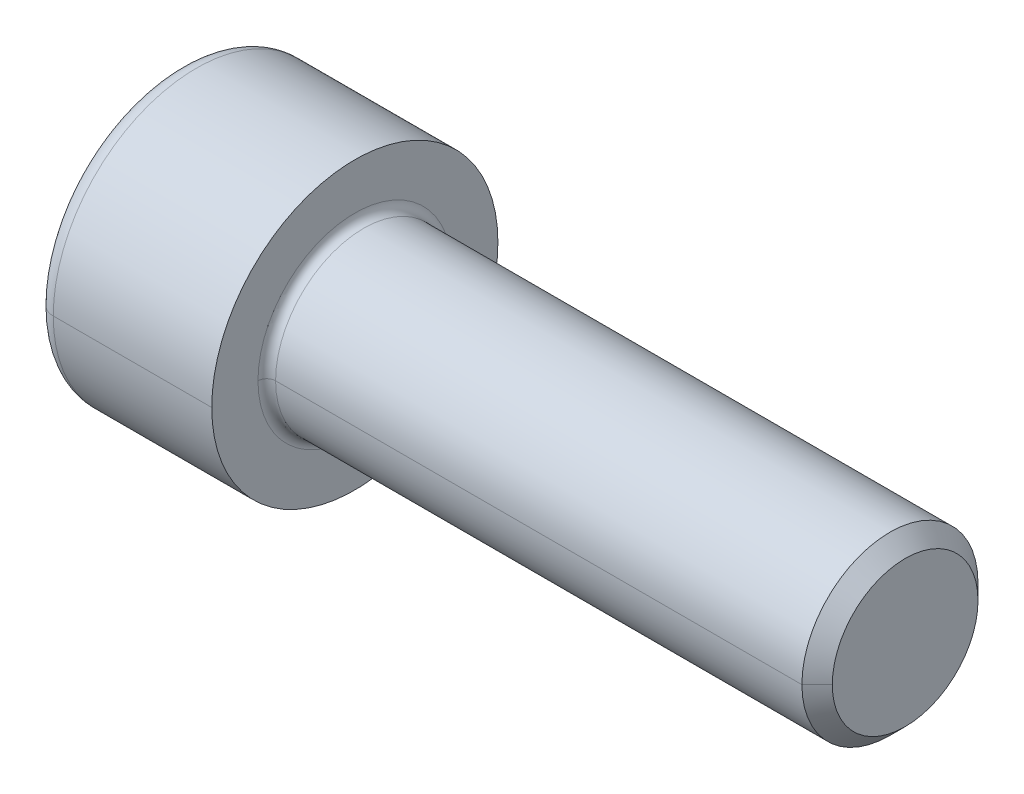
ISO-10303-21;
HEADER;
FILE_DESCRIPTION(('STEP AP214'),'2;1');
FILE_NAME('part.step','',(''),(''),'','','');
FILE_SCHEMA(('AUTOMOTIVE_DESIGN { 1 0 10303 214 1 1 1 1 }'));
ENDSEC;
DATA;
#1=APPLICATION_CONTEXT('core data for automotive mechanical design processes');
#2=APPLICATION_PROTOCOL_DEFINITION('international standard','automotive_design',2000,#1);
#3=PRODUCT_CONTEXT('',#1,'mechanical');
#4=PRODUCT('Part','Part','',(#3));
#5=PRODUCT_RELATED_PRODUCT_CATEGORY('part','',(#4));
#6=PRODUCT_DEFINITION_FORMATION('','',#4);
#7=PRODUCT_DEFINITION_CONTEXT('part definition',#1,'design');
#8=PRODUCT_DEFINITION('design','',#6,#7);
#9=PRODUCT_DEFINITION_SHAPE('','',#8);
#10=(LENGTH_UNIT() NAMED_UNIT(*) SI_UNIT(.MILLI.,.METRE.));
#11=(NAMED_UNIT(*) PLANE_ANGLE_UNIT() SI_UNIT($,.RADIAN.));
#12=(NAMED_UNIT(*) SI_UNIT($,.STERADIAN.) SOLID_ANGLE_UNIT());
#13=UNCERTAINTY_MEASURE_WITH_UNIT(LENGTH_MEASURE(1.E-05),#10,'distance_accuracy_value','');
#14=(GEOMETRIC_REPRESENTATION_CONTEXT(3) GLOBAL_UNCERTAINTY_ASSIGNED_CONTEXT((#13)) GLOBAL_UNIT_ASSIGNED_CONTEXT((#10,
#11,#12)) REPRESENTATION_CONTEXT('',''));
#15=CARTESIAN_POINT('',(0.,0.,0.));
#16=DIRECTION('',(0.,0.,1.));
#17=DIRECTION('',(1.,0.,0.));
#18=AXIS2_PLACEMENT_3D('',#15,#16,#17);
#19=CARTESIAN_POINT('',(4.,0.,0.));
#20=DIRECTION('',(-1.,0.,0.));
#21=DIRECTION('',(0.,0.,1.));
#22=AXIS2_PLACEMENT_3D('',#19,#20,#21);
#23=CONICAL_SURFACE('',#22,3.01,1.0471975511966);
#24=DIRECTION('',(-0.5,0.,0.866025403784436));
#25=VECTOR('',#24,1.);
#26=CARTESIAN_POINT('',(4.,0.,3.01));
#27=LINE('',#26,#25);
#28=CARTESIAN_POINT('',(5.73782431026079,0.,0.));
#29=VERTEX_POINT('',#28);
#30=CARTESIAN_POINT('',(4.,0.,3.01));
#31=VERTEX_POINT('',#30);
#32=EDGE_CURVE('E41',#29,#31,#27,.T.);
#33=ORIENTED_EDGE('',*,*,#32,.F.);
#34=DIRECTION('',(-0.5,0.,-0.866025403784436));
#35=VECTOR('',#34,1.);
#36=CARTESIAN_POINT('',(4.,0.,-3.01));
#37=LINE('',#36,#35);
#38=CARTESIAN_POINT('',(4.,0.,-3.01));
#39=VERTEX_POINT('',#38);
#40=EDGE_CURVE('E11',#29,#39,#37,.T.);
#41=ORIENTED_EDGE('',*,*,#40,.T.);
#42=CARTESIAN_POINT('',(4.,0.,0.));
#43=DIRECTION('',(-1.,0.,0.));
#44=DIRECTION('',(0.,0.,1.));
#45=AXIS2_PLACEMENT_3D('',#42,#43,#44);
#46=CIRCLE('',#45,3.01);
#47=CARTESIAN_POINT('',(4.,-2.60673646539116,-1.505));
#48=VERTEX_POINT('',#47);
#49=EDGE_CURVE('E27',#39,#48,#46,.T.);
#50=ORIENTED_EDGE('',*,*,#49,.T.);
#51=CARTESIAN_POINT('',(4.,0.,0.));
#52=DIRECTION('',(-1.,0.,0.));
#53=DIRECTION('',(0.,0.,1.));
#54=AXIS2_PLACEMENT_3D('',#51,#52,#53);
#55=CIRCLE('',#54,3.01);
#56=CARTESIAN_POINT('',(4.,-2.60673646539116,1.505));
#57=VERTEX_POINT('',#56);
#58=EDGE_CURVE('E294',#48,#57,#55,.T.);
#59=ORIENTED_EDGE('',*,*,#58,.T.);
#60=CARTESIAN_POINT('',(4.,0.,0.));
#61=DIRECTION('',(-1.,0.,0.));
#62=DIRECTION('',(0.,0.,1.));
#63=AXIS2_PLACEMENT_3D('',#60,#61,#62);
#64=CIRCLE('',#63,3.01);
#65=EDGE_CURVE('E245',#57,#31,#64,.T.);
#66=ORIENTED_EDGE('',*,*,#65,.T.);
#67=EDGE_LOOP('',(#33,#41,#50,#59,#66));
#68=FACE_BOUND('',#67,.T.);
#69=ADVANCED_FACE('F16',(#68),#23,.F.);
#70=CARTESIAN_POINT('',(0.8,0.,0.));
#71=DIRECTION('',(-1.,0.,0.));
#72=DIRECTION('',(0.,0.,1.));
#73=AXIS2_PLACEMENT_3D('',#70,#71,#72);
#74=TOROIDAL_SURFACE('',#73,5.7,0.8);
#75=CARTESIAN_POINT('',(0.8,0.,0.));
#76=DIRECTION('',(1.,0.,0.));
#77=DIRECTION('',(0.,0.,1.));
#78=AXIS2_PLACEMENT_3D('',#75,#76,#77);
#79=CIRCLE('',#78,6.5);
#80=CARTESIAN_POINT('',(0.8,0.,-6.5));
#81=VERTEX_POINT('',#80);
#82=CARTESIAN_POINT('',(0.8,0.,6.5));
#83=VERTEX_POINT('',#82);
#84=EDGE_CURVE('E217',#81,#83,#79,.T.);
#85=ORIENTED_EDGE('',*,*,#84,.F.);
#86=CARTESIAN_POINT('',(0.8,0.,-5.7));
#87=DIRECTION('',(0.,1.,0.));
#88=DIRECTION('',(0.,0.,1.));
#89=AXIS2_PLACEMENT_3D('',#86,#87,#88);
#90=CIRCLE('',#89,0.8);
#91=CARTESIAN_POINT('',(0.,0.,-5.7));
#92=VERTEX_POINT('',#91);
#93=EDGE_CURVE('E241',#81,#92,#90,.T.);
#94=ORIENTED_EDGE('',*,*,#93,.T.);
#95=CARTESIAN_POINT('',(0.,0.,0.));
#96=DIRECTION('',(-1.,0.,0.));
#97=DIRECTION('',(0.,0.,1.));
#98=AXIS2_PLACEMENT_3D('',#95,#96,#97);
#99=CIRCLE('',#98,5.7);
#100=CARTESIAN_POINT('',(0.,0.,5.7));
#101=VERTEX_POINT('',#100);
#102=EDGE_CURVE('E257',#101,#92,#99,.T.);
#103=ORIENTED_EDGE('',*,*,#102,.F.);
#104=CARTESIAN_POINT('',(0.8,0.,5.7));
#105=DIRECTION('',(0.,-1.,0.));
#106=DIRECTION('',(0.,0.,-1.));
#107=AXIS2_PLACEMENT_3D('',#104,#105,#106);
#108=CIRCLE('',#107,0.8);
#109=EDGE_CURVE('E148',#83,#101,#108,.T.);
#110=ORIENTED_EDGE('',*,*,#109,.F.);
#111=EDGE_LOOP('',(#85,#94,#103,#110));
#112=FACE_BOUND('',#111,.T.);
#113=ADVANCED_FACE('F458',(#112),#74,.T.);
#114=CARTESIAN_POINT('',(8.4,0.,0.));
#115=DIRECTION('',(1.,0.,0.));
#116=DIRECTION('',(0.,0.,-1.));
#117=AXIS2_PLACEMENT_3D('',#114,#115,#116);
#118=TOROIDAL_SURFACE('',#117,4.4,0.4);
#119=CARTESIAN_POINT('',(8.4,0.,0.));
#120=DIRECTION('',(1.,0.,0.));
#121=DIRECTION('',(0.,0.,-1.));
#122=AXIS2_PLACEMENT_3D('',#119,#120,#121);
#123=CIRCLE('',#122,4.);
#124=CARTESIAN_POINT('',(8.4,0.,4.));
#125=VERTEX_POINT('',#124);
#126=CARTESIAN_POINT('',(8.4,0.,-4.));
#127=VERTEX_POINT('',#126);
#128=EDGE_CURVE('E188',#125,#127,#123,.T.);
#129=ORIENTED_EDGE('',*,*,#128,.F.);
#130=CARTESIAN_POINT('',(8.4,0.,4.4));
#131=DIRECTION('',(0.,1.,0.));
#132=DIRECTION('',(0.,0.,1.));
#133=AXIS2_PLACEMENT_3D('',#130,#131,#132);
#134=CIRCLE('',#133,0.4);
#135=CARTESIAN_POINT('',(8.,0.,4.4));
#136=VERTEX_POINT('',#135);
#137=EDGE_CURVE('E152',#125,#136,#134,.T.);
#138=ORIENTED_EDGE('',*,*,#137,.T.);
#139=CARTESIAN_POINT('',(8.,0.,0.));
#140=DIRECTION('',(-1.,0.,0.));
#141=DIRECTION('',(0.,0.,-1.));
#142=AXIS2_PLACEMENT_3D('',#139,#140,#141);
#143=CIRCLE('',#142,4.4);
#144=CARTESIAN_POINT('',(8.,0.,-4.4));
#145=VERTEX_POINT('',#144);
#146=EDGE_CURVE('E150',#145,#136,#143,.T.);
#147=ORIENTED_EDGE('',*,*,#146,.F.);
#148=CARTESIAN_POINT('',(8.4,0.,-4.4));
#149=DIRECTION('',(0.,-1.,0.));
#150=DIRECTION('',(0.,0.,-1.));
#151=AXIS2_PLACEMENT_3D('',#148,#149,#150);
#152=CIRCLE('',#151,0.4);
#153=EDGE_CURVE('E136',#127,#145,#152,.T.);
#154=ORIENTED_EDGE('',*,*,#153,.F.);
#155=EDGE_LOOP('',(#129,#138,#147,#154));
#156=FACE_BOUND('',#155,.T.);
#157=ADVANCED_FACE('F151',(#156),#118,.F.);
#158=CARTESIAN_POINT('',(33.,0.,0.));
#159=DIRECTION('',(-1.,0.,0.));
#160=DIRECTION('',(0.,0.,1.));
#161=AXIS2_PLACEMENT_3D('',#158,#159,#160);
#162=CONICAL_SURFACE('',#161,3.3095,0.78539816339745);
#163=CARTESIAN_POINT('',(33.,0.,0.));
#164=DIRECTION('',(-1.,0.,0.));
#165=DIRECTION('',(0.,0.,1.));
#166=AXIS2_PLACEMENT_3D('',#163,#164,#165);
#167=CIRCLE('',#166,3.3095);
#168=CARTESIAN_POINT('',(33.,0.,3.3095));
#169=VERTEX_POINT('',#168);
#170=CARTESIAN_POINT('',(33.,0.,-3.3095));
#171=VERTEX_POINT('',#170);
#172=EDGE_CURVE('E273',#169,#171,#167,.T.);
#173=ORIENTED_EDGE('',*,*,#172,.T.);
#174=DIRECTION('',(-0.707106781186546,0.,-0.707106781186549));
#175=VECTOR('',#174,1.);
#176=CARTESIAN_POINT('',(33.,0.,-3.3095));
#177=LINE('',#176,#175);
#178=CARTESIAN_POINT('',(32.3095,0.,-4.));
#179=VERTEX_POINT('',#178);
#180=EDGE_CURVE('E403',#171,#179,#177,.T.);
#181=ORIENTED_EDGE('',*,*,#180,.T.);
#182=CARTESIAN_POINT('',(32.3095,0.,0.));
#183=DIRECTION('',(-1.,0.,0.));
#184=DIRECTION('',(0.,0.,1.));
#185=AXIS2_PLACEMENT_3D('',#182,#183,#184);
#186=CIRCLE('',#185,4.);
#187=CARTESIAN_POINT('',(32.3095,0.,4.));
#188=VERTEX_POINT('',#187);
#189=EDGE_CURVE('E222',#188,#179,#186,.T.);
#190=ORIENTED_EDGE('',*,*,#189,.F.);
#191=DIRECTION('',(-0.707106781186546,0.,0.707106781186549));
#192=VECTOR('',#191,1.);
#193=CARTESIAN_POINT('',(33.,0.,3.3095));
#194=LINE('',#193,#192);
#195=EDGE_CURVE('E147',#169,#188,#194,.T.);
#196=ORIENTED_EDGE('',*,*,#195,.F.);
#197=EDGE_LOOP('',(#173,#181,#190,#196));
#198=FACE_BOUND('',#197,.T.);
#199=ADVANCED_FACE('F417',(#198),#162,.T.);
#200=CARTESIAN_POINT('',(-31.75,0.,0.));
#201=DIRECTION('',(-1.,0.,0.));
#202=DIRECTION('',(0.,0.,1.));
#203=AXIS2_PLACEMENT_3D('',#200,#201,#202);
#204=CYLINDRICAL_SURFACE('',#203,4.);
#205=ORIENTED_EDGE('',*,*,#189,.T.);
#206=DIRECTION('',(-1.,0.,0.));
#207=VECTOR('',#206,1.);
#208=CARTESIAN_POINT('',(-31.75,0.,-4.));
#209=LINE('',#208,#207);
#210=EDGE_CURVE('E218',#179,#127,#209,.T.);
#211=ORIENTED_EDGE('',*,*,#210,.T.);
#212=CARTESIAN_POINT('',(8.4,0.,0.));
#213=DIRECTION('',(1.,0.,0.));
#214=DIRECTION('',(0.,0.,-1.));
#215=AXIS2_PLACEMENT_3D('',#212,#213,#214);
#216=CIRCLE('',#215,4.);
#217=EDGE_CURVE('E143',#127,#125,#216,.T.);
#218=ORIENTED_EDGE('',*,*,#217,.T.);
#219=DIRECTION('',(-1.,0.,0.));
#220=VECTOR('',#219,1.);
#221=CARTESIAN_POINT('',(-31.75,0.,4.));
#222=LINE('',#221,#220);
#223=EDGE_CURVE('E166',#188,#125,#222,.T.);
#224=ORIENTED_EDGE('',*,*,#223,.F.);
#225=EDGE_LOOP('',(#205,#211,#218,#224));
#226=FACE_BOUND('',#225,.T.);
#227=ADVANCED_FACE('F481',(#226),#204,.T.);
#228=CARTESIAN_POINT('',(-31.75,0.,0.));
#229=DIRECTION('',(-1.,0.,0.));
#230=DIRECTION('',(0.,0.,1.));
#231=AXIS2_PLACEMENT_3D('',#228,#229,#230);
#232=CYLINDRICAL_SURFACE('',#231,6.5);
#233=CARTESIAN_POINT('',(8.,0.,0.));
#234=DIRECTION('',(-1.,0.,0.));
#235=DIRECTION('',(0.,0.,1.));
#236=AXIS2_PLACEMENT_3D('',#233,#234,#235);
#237=CIRCLE('',#236,6.5);
#238=CARTESIAN_POINT('',(8.,0.,6.5));
#239=VERTEX_POINT('',#238);
#240=CARTESIAN_POINT('',(8.,0.,-6.5));
#241=VERTEX_POINT('',#240);
#242=EDGE_CURVE('E216',#239,#241,#237,.T.);
#243=ORIENTED_EDGE('',*,*,#242,.T.);
#244=DIRECTION('',(-1.,0.,0.));
#245=VECTOR('',#244,1.);
#246=CARTESIAN_POINT('',(-31.75,0.,-6.5));
#247=LINE('',#246,#245);
#248=EDGE_CURVE('E212',#241,#81,#247,.T.);
#249=ORIENTED_EDGE('',*,*,#248,.T.);
#250=ORIENTED_EDGE('',*,*,#84,.T.);
#251=DIRECTION('',(-1.,0.,0.));
#252=VECTOR('',#251,1.);
#253=CARTESIAN_POINT('',(-31.75,0.,6.5));
#254=LINE('',#253,#252);
#255=EDGE_CURVE('E249',#239,#83,#254,.T.);
#256=ORIENTED_EDGE('',*,*,#255,.F.);
#257=EDGE_LOOP('',(#243,#249,#250,#256));
#258=FACE_BOUND('',#257,.T.);
#259=ADVANCED_FACE('F18',(#258),#232,.T.);
#260=CARTESIAN_POINT('',(0.,0.,0.));
#261=DIRECTION('',(-1.,0.,0.));
#262=DIRECTION('',(0.,0.,1.));
#263=AXIS2_PLACEMENT_3D('',#260,#261,#262);
#264=PLANE('',#263);
#265=ORIENTED_EDGE('',*,*,#102,.T.);
#266=CARTESIAN_POINT('',(0.,0.,0.));
#267=DIRECTION('',(-1.,0.,0.));
#268=DIRECTION('',(0.,0.,1.));
#269=AXIS2_PLACEMENT_3D('',#266,#267,#268);
#270=CIRCLE('',#269,5.7);
#271=EDGE_CURVE('E253',#92,#101,#270,.T.);
#272=ORIENTED_EDGE('',*,*,#271,.T.);
#273=EDGE_LOOP('',(#265,#272));
#274=FACE_BOUND('',#273,.T.);
#275=DIRECTION('',(0.,-0.5,0.866025403784439));
#276=VECTOR('',#275,1.);
#277=CARTESIAN_POINT('',(0.,3.47564862052154,0.));
#278=LINE('',#277,#276);
#279=CARTESIAN_POINT('',(0.,3.47564862052154,0.));
#280=VERTEX_POINT('',#279);
#281=CARTESIAN_POINT('',(0.,1.73782431026077,3.01));
#282=VERTEX_POINT('',#281);
#283=EDGE_CURVE('E179',#280,#282,#278,.T.);
#284=ORIENTED_EDGE('',*,*,#283,.T.);
#285=DIRECTION('',(0.,1.,0.));
#286=VECTOR('',#285,1.);
#287=CARTESIAN_POINT('',(0.,-1.73782431026077,3.01));
#288=LINE('',#287,#286);
#289=CARTESIAN_POINT('',(0.,-1.73782431026077,3.01));
#290=VERTEX_POINT('',#289);
#291=EDGE_CURVE('E187',#290,#282,#288,.T.);
#292=ORIENTED_EDGE('',*,*,#291,.F.);
#293=DIRECTION('',(0.,-0.5,-0.866025403784438));
#294=VECTOR('',#293,1.);
#295=CARTESIAN_POINT('',(0.,-1.73782431026077,3.01));
#296=LINE('',#295,#294);
#297=CARTESIAN_POINT('',(0.,-3.47564862052155,0.));
#298=VERTEX_POINT('',#297);
#299=EDGE_CURVE('E176',#290,#298,#296,.T.);
#300=ORIENTED_EDGE('',*,*,#299,.T.);
#301=DIRECTION('',(0.,0.5,-0.866025403784439));
#302=VECTOR('',#301,1.);
#303=CARTESIAN_POINT('',(0.,-3.47564862052155,0.));
#304=LINE('',#303,#302);
#305=CARTESIAN_POINT('',(0.,-1.73782431026078,-3.01));
#306=VERTEX_POINT('',#305);
#307=EDGE_CURVE('E180',#298,#306,#304,.T.);
#308=ORIENTED_EDGE('',*,*,#307,.T.);
#309=DIRECTION('',(0.,-1.,0.));
#310=VECTOR('',#309,1.);
#311=CARTESIAN_POINT('',(0.,1.73782431026077,-3.01));
#312=LINE('',#311,#310);
#313=CARTESIAN_POINT('',(0.,1.73782431026077,-3.01));
#314=VERTEX_POINT('',#313);
#315=EDGE_CURVE('E202',#314,#306,#312,.T.);
#316=ORIENTED_EDGE('',*,*,#315,.F.);
#317=DIRECTION('',(0.,-0.5,-0.866025403784438));
#318=VECTOR('',#317,1.);
#319=CARTESIAN_POINT('',(0.,3.47564862052154,0.));
#320=LINE('',#319,#318);
#321=EDGE_CURVE('E203',#280,#314,#320,.T.);
#322=ORIENTED_EDGE('',*,*,#321,.F.);
#323=EDGE_LOOP('',(#284,#292,#300,#308,#316,#322));
#324=FACE_BOUND('',#323,.T.);
#325=ADVANCED_FACE('F378',(#274,#324),#264,.T.);
#326=CARTESIAN_POINT('',(-31.75,0.,0.));
#327=DIRECTION('',(-1.,0.,0.));
#328=DIRECTION('',(0.,0.,1.));
#329=AXIS2_PLACEMENT_3D('',#326,#327,#328);
#330=CYLINDRICAL_SURFACE('',#329,6.5);
#331=ORIENTED_EDGE('',*,*,#248,.F.);
#332=CARTESIAN_POINT('',(8.,0.,0.));
#333=DIRECTION('',(-1.,0.,0.));
#334=DIRECTION('',(0.,0.,1.));
#335=AXIS2_PLACEMENT_3D('',#332,#333,#334);
#336=CIRCLE('',#335,6.5);
#337=EDGE_CURVE('E226',#241,#239,#336,.T.);
#338=ORIENTED_EDGE('',*,*,#337,.T.);
#339=ORIENTED_EDGE('',*,*,#255,.T.);
#340=CARTESIAN_POINT('',(0.8,0.,0.));
#341=DIRECTION('',(1.,0.,0.));
#342=DIRECTION('',(0.,0.,1.));
#343=AXIS2_PLACEMENT_3D('',#340,#341,#342);
#344=CIRCLE('',#343,6.5);
#345=EDGE_CURVE('E155',#83,#81,#344,.T.);
#346=ORIENTED_EDGE('',*,*,#345,.T.);
#347=EDGE_LOOP('',(#331,#338,#339,#346));
#348=FACE_BOUND('',#347,.T.);
#349=ADVANCED_FACE('F472',(#348),#330,.T.);
#350=CARTESIAN_POINT('',(8.,6.5,0.));
#351=DIRECTION('',(1.,0.,0.));
#352=DIRECTION('',(0.,1.,0.));
#353=AXIS2_PLACEMENT_3D('',#350,#351,#352);
#354=PLANE('',#353);
#355=ORIENTED_EDGE('',*,*,#242,.F.);
#356=ORIENTED_EDGE('',*,*,#337,.F.);
#357=EDGE_LOOP('',(#355,#356));
#358=FACE_BOUND('',#357,.T.);
#359=ORIENTED_EDGE('',*,*,#146,.T.);
#360=CARTESIAN_POINT('',(8.,0.,0.));
#361=DIRECTION('',(-1.,0.,0.));
#362=DIRECTION('',(0.,0.,-1.));
#363=AXIS2_PLACEMENT_3D('',#360,#361,#362);
#364=CIRCLE('',#363,4.4);
#365=EDGE_CURVE('E141',#136,#145,#364,.T.);
#366=ORIENTED_EDGE('',*,*,#365,.T.);
#367=EDGE_LOOP('',(#359,#366));
#368=FACE_BOUND('',#367,.T.);
#369=ADVANCED_FACE('F157',(#358,#368),#354,.T.);
#370=CARTESIAN_POINT('',(-31.75,0.,0.));
#371=DIRECTION('',(-1.,0.,0.));
#372=DIRECTION('',(0.,0.,1.));
#373=AXIS2_PLACEMENT_3D('',#370,#371,#372);
#374=CYLINDRICAL_SURFACE('',#373,4.);
#375=ORIENTED_EDGE('',*,*,#210,.F.);
#376=CARTESIAN_POINT('',(32.3095,0.,0.));
#377=DIRECTION('',(-1.,0.,0.));
#378=DIRECTION('',(0.,0.,1.));
#379=AXIS2_PLACEMENT_3D('',#376,#377,#378);
#380=CIRCLE('',#379,4.);
#381=EDGE_CURVE('E159',#179,#188,#380,.T.);
#382=ORIENTED_EDGE('',*,*,#381,.T.);
#383=ORIENTED_EDGE('',*,*,#223,.T.);
#384=ORIENTED_EDGE('',*,*,#128,.T.);
#385=EDGE_LOOP('',(#375,#382,#383,#384));
#386=FACE_BOUND('',#385,.T.);
#387=ADVANCED_FACE('F471',(#386),#374,.T.);
#388=CARTESIAN_POINT('',(33.,0.,0.));
#389=DIRECTION('',(-1.,0.,0.));
#390=DIRECTION('',(0.,0.,1.));
#391=AXIS2_PLACEMENT_3D('',#388,#389,#390);
#392=CONICAL_SURFACE('',#391,3.3095,0.78539816339745);
#393=ORIENTED_EDGE('',*,*,#180,.F.);
#394=CARTESIAN_POINT('',(33.,0.,0.));
#395=DIRECTION('',(-1.,0.,0.));
#396=DIRECTION('',(0.,0.,1.));
#397=AXIS2_PLACEMENT_3D('',#394,#395,#396);
#398=CIRCLE('',#397,3.3095);
#399=EDGE_CURVE('E191',#171,#169,#398,.T.);
#400=ORIENTED_EDGE('',*,*,#399,.T.);
#401=ORIENTED_EDGE('',*,*,#195,.T.);
#402=ORIENTED_EDGE('',*,*,#381,.F.);
#403=EDGE_LOOP('',(#393,#400,#401,#402));
#404=FACE_BOUND('',#403,.T.);
#405=ADVANCED_FACE('F424',(#404),#392,.T.);
#406=CARTESIAN_POINT('',(33.,3.3095,0.));
#407=DIRECTION('',(1.,0.,0.));
#408=DIRECTION('',(0.,1.,0.));
#409=AXIS2_PLACEMENT_3D('',#406,#407,#408);
#410=PLANE('',#409);
#411=ORIENTED_EDGE('',*,*,#172,.F.);
#412=ORIENTED_EDGE('',*,*,#399,.F.);
#413=EDGE_LOOP('',(#411,#412));
#414=FACE_BOUND('',#413,.T.);
#415=ADVANCED_FACE('F422',(#414),#410,.T.);
#416=CARTESIAN_POINT('',(8.4,0.,0.));
#417=DIRECTION('',(1.,0.,0.));
#418=DIRECTION('',(0.,0.,-1.));
#419=AXIS2_PLACEMENT_3D('',#416,#417,#418);
#420=TOROIDAL_SURFACE('',#419,4.4,0.4);
#421=ORIENTED_EDGE('',*,*,#137,.F.);
#422=ORIENTED_EDGE('',*,*,#217,.F.);
#423=ORIENTED_EDGE('',*,*,#153,.T.);
#424=ORIENTED_EDGE('',*,*,#365,.F.);
#425=EDGE_LOOP('',(#421,#422,#423,#424));
#426=FACE_BOUND('',#425,.T.);
#427=ADVANCED_FACE('F139',(#426),#420,.F.);
#428=CARTESIAN_POINT('',(0.8,0.,0.));
#429=DIRECTION('',(-1.,0.,0.));
#430=DIRECTION('',(0.,0.,1.));
#431=AXIS2_PLACEMENT_3D('',#428,#429,#430);
#432=TOROIDAL_SURFACE('',#431,5.7,0.8);
#433=ORIENTED_EDGE('',*,*,#93,.F.);
#434=ORIENTED_EDGE('',*,*,#345,.F.);
#435=ORIENTED_EDGE('',*,*,#109,.T.);
#436=ORIENTED_EDGE('',*,*,#271,.F.);
#437=EDGE_LOOP('',(#433,#434,#435,#436));
#438=FACE_BOUND('',#437,.T.);
#439=ADVANCED_FACE('F478',(#438),#432,.T.);
#440=CARTESIAN_POINT('',(4.,3.47564862052154,0.));
#441=DIRECTION('',(0.,-0.866025403784439,-0.5));
#442=DIRECTION('',(0.,0.5,-0.866025403784439));
#443=AXIS2_PLACEMENT_3D('',#440,#441,#442);
#444=PLANE('',#443);
#445=ORIENTED_EDGE('',*,*,#283,.F.);
#446=DIRECTION('',(-1.,0.,0.));
#447=VECTOR('',#446,1.);
#448=CARTESIAN_POINT('',(4.,3.47564862052154,0.));
#449=LINE('',#448,#447);
#450=CARTESIAN_POINT('',(4.,3.47564862052154,0.));
#451=VERTEX_POINT('',#450);
#452=EDGE_CURVE('E196',#451,#280,#449,.T.);
#453=ORIENTED_EDGE('',*,*,#452,.F.);
#454=DIRECTION('',(0.,-0.5,0.866025403784439));
#455=VECTOR('',#454,1.);
#456=CARTESIAN_POINT('',(4.,3.47564862052154,0.));
#457=LINE('',#456,#455);
#458=CARTESIAN_POINT('',(4.,2.60673646539116,1.505));
#459=VERTEX_POINT('',#458);
#460=EDGE_CURVE('E230',#451,#459,#457,.T.);
#461=ORIENTED_EDGE('',*,*,#460,.T.);
#462=DIRECTION('',(0.,-0.5,0.866025403784439));
#463=VECTOR('',#462,1.);
#464=CARTESIAN_POINT('',(4.,3.47564862052154,0.));
#465=LINE('',#464,#463);
#466=CARTESIAN_POINT('',(4.,1.73782431026077,3.01));
#467=VERTEX_POINT('',#466);
#468=EDGE_CURVE('E186',#459,#467,#465,.T.);
#469=ORIENTED_EDGE('',*,*,#468,.T.);
#470=DIRECTION('',(-1.,0.,0.));
#471=VECTOR('',#470,1.);
#472=CARTESIAN_POINT('',(4.,1.73782431026077,3.01));
#473=LINE('',#472,#471);
#474=EDGE_CURVE('E182',#467,#282,#473,.T.);
#475=ORIENTED_EDGE('',*,*,#474,.T.);
#476=EDGE_LOOP('',(#445,#453,#461,#469,#475));
#477=FACE_BOUND('',#476,.T.);
#478=ADVANCED_FACE('F392',(#477),#444,.T.);
#479=CARTESIAN_POINT('',(4.,-1.73782431026077,3.01));
#480=DIRECTION('',(0.,0.,1.));
#481=DIRECTION('',(0.,-1.,0.));
#482=AXIS2_PLACEMENT_3D('',#479,#480,#481);
#483=PLANE('',#482);
#484=ORIENTED_EDGE('',*,*,#291,.T.);
#485=ORIENTED_EDGE('',*,*,#474,.F.);
#486=DIRECTION('',(0.,1.,0.));
#487=VECTOR('',#486,1.);
#488=CARTESIAN_POINT('',(4.,-1.73782431026077,3.01));
#489=LINE('',#488,#487);
#490=EDGE_CURVE('E231',#31,#467,#489,.T.);
#491=ORIENTED_EDGE('',*,*,#490,.F.);
#492=DIRECTION('',(0.,1.,0.));
#493=VECTOR('',#492,1.);
#494=CARTESIAN_POINT('',(4.,-1.73782431026077,3.01));
#495=LINE('',#494,#493);
#496=CARTESIAN_POINT('',(4.,-1.73782431026077,3.01));
#497=VERTEX_POINT('',#496);
#498=EDGE_CURVE('E197',#497,#31,#495,.T.);
#499=ORIENTED_EDGE('',*,*,#498,.F.);
#500=DIRECTION('',(-1.,0.,0.));
#501=VECTOR('',#500,1.);
#502=CARTESIAN_POINT('',(4.,-1.73782431026077,3.01));
#503=LINE('',#502,#501);
#504=EDGE_CURVE('E204',#497,#290,#503,.T.);
#505=ORIENTED_EDGE('',*,*,#504,.T.);
#506=EDGE_LOOP('',(#484,#485,#491,#499,#505));
#507=FACE_BOUND('',#506,.T.);
#508=ADVANCED_FACE('F439',(#507),#483,.F.);
#509=CARTESIAN_POINT('',(4.,-1.73782431026077,3.01));
#510=DIRECTION('',(0.,0.866025403784438,-0.5));
#511=DIRECTION('',(-1.,0.,0.));
#512=AXIS2_PLACEMENT_3D('',#509,#510,#511);
#513=PLANE('',#512);
#514=ORIENTED_EDGE('',*,*,#299,.F.);
#515=ORIENTED_EDGE('',*,*,#504,.F.);
#516=DIRECTION('',(0.,-0.5,-0.866025403784438));
#517=VECTOR('',#516,1.);
#518=CARTESIAN_POINT('',(4.,-1.73782431026077,3.01));
#519=LINE('',#518,#517);
#520=EDGE_CURVE('E208',#497,#57,#519,.T.);
#521=ORIENTED_EDGE('',*,*,#520,.T.);
#522=DIRECTION('',(0.,-0.5,-0.866025403784438));
#523=VECTOR('',#522,1.);
#524=CARTESIAN_POINT('',(4.,-1.73782431026077,3.01));
#525=LINE('',#524,#523);
#526=CARTESIAN_POINT('',(4.,-3.47564862052155,0.));
#527=VERTEX_POINT('',#526);
#528=EDGE_CURVE('E274',#57,#527,#525,.T.);
#529=ORIENTED_EDGE('',*,*,#528,.T.);
#530=DIRECTION('',(-1.,0.,0.));
#531=VECTOR('',#530,1.);
#532=CARTESIAN_POINT('',(4.,-3.47564862052155,0.));
#533=LINE('',#532,#531);
#534=EDGE_CURVE('E20',#527,#298,#533,.T.);
#535=ORIENTED_EDGE('',*,*,#534,.T.);
#536=EDGE_LOOP('',(#514,#515,#521,#529,#535));
#537=FACE_BOUND('',#536,.T.);
#538=ADVANCED_FACE('F338',(#537),#513,.T.);
#539=CARTESIAN_POINT('',(4.,-3.47564862052155,0.));
#540=DIRECTION('',(0.,0.866025403784439,0.5));
#541=DIRECTION('',(1.,0.,0.));
#542=AXIS2_PLACEMENT_3D('',#539,#540,#541);
#543=PLANE('',#542);
#544=ORIENTED_EDGE('',*,*,#307,.F.);
#545=ORIENTED_EDGE('',*,*,#534,.F.);
#546=DIRECTION('',(0.,0.5,-0.866025403784439));
#547=VECTOR('',#546,1.);
#548=CARTESIAN_POINT('',(4.,-3.47564862052155,0.));
#549=LINE('',#548,#547);
#550=EDGE_CURVE('E309',#527,#48,#549,.T.);
#551=ORIENTED_EDGE('',*,*,#550,.T.);
#552=DIRECTION('',(0.,0.5,-0.866025403784439));
#553=VECTOR('',#552,1.);
#554=CARTESIAN_POINT('',(4.,-3.47564862052155,0.));
#555=LINE('',#554,#553);
#556=CARTESIAN_POINT('',(4.,-1.73782431026078,-3.01));
#557=VERTEX_POINT('',#556);
#558=EDGE_CURVE('E311',#48,#557,#555,.T.);
#559=ORIENTED_EDGE('',*,*,#558,.T.);
#560=DIRECTION('',(-1.,0.,0.));
#561=VECTOR('',#560,1.);
#562=CARTESIAN_POINT('',(4.,-1.73782431026078,-3.01));
#563=LINE('',#562,#561);
#564=EDGE_CURVE('E319',#557,#306,#563,.T.);
#565=ORIENTED_EDGE('',*,*,#564,.T.);
#566=EDGE_LOOP('',(#544,#545,#551,#559,#565));
#567=FACE_BOUND('',#566,.T.);
#568=ADVANCED_FACE('F437',(#567),#543,.T.);
#569=CARTESIAN_POINT('',(4.,1.73782431026077,-3.01));
#570=DIRECTION('',(0.,0.,-1.));
#571=DIRECTION('',(0.,-1.,0.));
#572=AXIS2_PLACEMENT_3D('',#569,#570,#571);
#573=PLANE('',#572);
#574=ORIENTED_EDGE('',*,*,#315,.T.);
#575=ORIENTED_EDGE('',*,*,#564,.F.);
#576=DIRECTION('',(0.,-1.,0.));
#577=VECTOR('',#576,1.);
#578=CARTESIAN_POINT('',(4.,1.73782431026077,-3.01));
#579=LINE('',#578,#577);
#580=EDGE_CURVE('E192',#39,#557,#579,.T.);
#581=ORIENTED_EDGE('',*,*,#580,.F.);
#582=DIRECTION('',(0.,-1.,0.));
#583=VECTOR('',#582,1.);
#584=CARTESIAN_POINT('',(4.,1.73782431026077,-3.01));
#585=LINE('',#584,#583);
#586=CARTESIAN_POINT('',(4.,1.73782431026077,-3.01));
#587=VERTEX_POINT('',#586);
#588=EDGE_CURVE('E174',#587,#39,#585,.T.);
#589=ORIENTED_EDGE('',*,*,#588,.F.);
#590=DIRECTION('',(-1.,0.,0.));
#591=VECTOR('',#590,1.);
#592=CARTESIAN_POINT('',(4.,1.73782431026077,-3.01));
#593=LINE('',#592,#591);
#594=EDGE_CURVE('E198',#587,#314,#593,.T.);
#595=ORIENTED_EDGE('',*,*,#594,.T.);
#596=EDGE_LOOP('',(#574,#575,#581,#589,#595));
#597=FACE_BOUND('',#596,.T.);
#598=ADVANCED_FACE('F381',(#597),#573,.F.);
#599=CARTESIAN_POINT('',(4.,3.47564862052154,0.));
#600=DIRECTION('',(0.,0.866025403784438,-0.5));
#601=DIRECTION('',(-1.,0.,0.));
#602=AXIS2_PLACEMENT_3D('',#599,#600,#601);
#603=PLANE('',#602);
#604=ORIENTED_EDGE('',*,*,#321,.T.);
#605=ORIENTED_EDGE('',*,*,#594,.F.);
#606=DIRECTION('',(0.,-0.5,-0.866025403784438));
#607=VECTOR('',#606,1.);
#608=CARTESIAN_POINT('',(4.,3.47564862052154,0.));
#609=LINE('',#608,#607);
#610=CARTESIAN_POINT('',(4.,2.60673646539116,-1.505));
#611=VERTEX_POINT('',#610);
#612=EDGE_CURVE('E264',#611,#587,#609,.T.);
#613=ORIENTED_EDGE('',*,*,#612,.F.);
#614=DIRECTION('',(0.,-0.5,-0.866025403784438));
#615=VECTOR('',#614,1.);
#616=CARTESIAN_POINT('',(4.,3.47564862052154,0.));
#617=LINE('',#616,#615);
#618=EDGE_CURVE('E235',#451,#611,#617,.T.);
#619=ORIENTED_EDGE('',*,*,#618,.F.);
#620=ORIENTED_EDGE('',*,*,#452,.T.);
#621=EDGE_LOOP('',(#604,#605,#613,#619,#620));
#622=FACE_BOUND('',#621,.T.);
#623=ADVANCED_FACE('F371',(#622),#603,.F.);
#624=CARTESIAN_POINT('',(4.,0.,6.02));
#625=DIRECTION('',(1.,0.,0.));
#626=DIRECTION('',(0.,1.,0.));
#627=AXIS2_PLACEMENT_3D('',#624,#625,#626);
#628=PLANE('',#627);
#629=ORIENTED_EDGE('',*,*,#580,.T.);
#630=ORIENTED_EDGE('',*,*,#558,.F.);
#631=ORIENTED_EDGE('',*,*,#49,.F.);
#632=EDGE_LOOP('',(#629,#630,#631));
#633=FACE_BOUND('',#632,.T.);
#634=ADVANCED_FACE('F453',(#633),#628,.F.);
#635=CARTESIAN_POINT('',(4.,0.,6.02));
#636=DIRECTION('',(1.,0.,0.));
#637=DIRECTION('',(0.,1.,0.));
#638=AXIS2_PLACEMENT_3D('',#635,#636,#637);
#639=PLANE('',#638);
#640=ORIENTED_EDGE('',*,*,#550,.F.);
#641=ORIENTED_EDGE('',*,*,#528,.F.);
#642=ORIENTED_EDGE('',*,*,#58,.F.);
#643=EDGE_LOOP('',(#640,#641,#642));
#644=FACE_BOUND('',#643,.T.);
#645=ADVANCED_FACE('F334',(#644),#639,.F.);
#646=CARTESIAN_POINT('',(4.,0.,6.02));
#647=DIRECTION('',(1.,0.,0.));
#648=DIRECTION('',(0.,1.,0.));
#649=AXIS2_PLACEMENT_3D('',#646,#647,#648);
#650=PLANE('',#649);
#651=ORIENTED_EDGE('',*,*,#520,.F.);
#652=ORIENTED_EDGE('',*,*,#498,.T.);
#653=ORIENTED_EDGE('',*,*,#65,.F.);
#654=EDGE_LOOP('',(#651,#652,#653));
#655=FACE_BOUND('',#654,.T.);
#656=ADVANCED_FACE('F442',(#655),#650,.F.);
#657=CARTESIAN_POINT('',(4.,0.,6.02));
#658=DIRECTION('',(1.,0.,0.));
#659=DIRECTION('',(0.,1.,0.));
#660=AXIS2_PLACEMENT_3D('',#657,#658,#659);
#661=PLANE('',#660);
#662=ORIENTED_EDGE('',*,*,#490,.T.);
#663=ORIENTED_EDGE('',*,*,#468,.F.);
#664=CARTESIAN_POINT('',(4.,0.,0.));
#665=DIRECTION('',(-1.,0.,0.));
#666=DIRECTION('',(0.,0.,1.));
#667=AXIS2_PLACEMENT_3D('',#664,#665,#666);
#668=CIRCLE('',#667,3.01);
#669=EDGE_CURVE('E175',#31,#459,#668,.T.);
#670=ORIENTED_EDGE('',*,*,#669,.F.);
#671=EDGE_LOOP('',(#662,#663,#670));
#672=FACE_BOUND('',#671,.T.);
#673=ADVANCED_FACE('F444',(#672),#661,.F.);
#674=CARTESIAN_POINT('',(4.,0.,6.02));
#675=DIRECTION('',(1.,0.,0.));
#676=DIRECTION('',(0.,1.,0.));
#677=AXIS2_PLACEMENT_3D('',#674,#675,#676);
#678=PLANE('',#677);
#679=ORIENTED_EDGE('',*,*,#460,.F.);
#680=ORIENTED_EDGE('',*,*,#618,.T.);
#681=CARTESIAN_POINT('',(4.,0.,0.));
#682=DIRECTION('',(-1.,0.,0.));
#683=DIRECTION('',(0.,0.,1.));
#684=AXIS2_PLACEMENT_3D('',#681,#682,#683);
#685=CIRCLE('',#684,3.01);
#686=EDGE_CURVE('E211',#459,#611,#685,.T.);
#687=ORIENTED_EDGE('',*,*,#686,.F.);
#688=EDGE_LOOP('',(#679,#680,#687));
#689=FACE_BOUND('',#688,.T.);
#690=ADVANCED_FACE('F389',(#689),#678,.F.);
#691=CARTESIAN_POINT('',(4.,0.,6.02));
#692=DIRECTION('',(1.,0.,0.));
#693=DIRECTION('',(0.,1.,0.));
#694=AXIS2_PLACEMENT_3D('',#691,#692,#693);
#695=PLANE('',#694);
#696=ORIENTED_EDGE('',*,*,#612,.T.);
#697=ORIENTED_EDGE('',*,*,#588,.T.);
#698=CARTESIAN_POINT('',(4.,0.,0.));
#699=DIRECTION('',(-1.,0.,0.));
#700=DIRECTION('',(0.,0.,1.));
#701=AXIS2_PLACEMENT_3D('',#698,#699,#700);
#702=CIRCLE('',#701,3.01);
#703=EDGE_CURVE('E170',#611,#39,#702,.T.);
#704=ORIENTED_EDGE('',*,*,#703,.F.);
#705=EDGE_LOOP('',(#696,#697,#704));
#706=FACE_BOUND('',#705,.T.);
#707=ADVANCED_FACE('F384',(#706),#695,.F.);
#708=CARTESIAN_POINT('',(4.,0.,0.));
#709=DIRECTION('',(-1.,0.,0.));
#710=DIRECTION('',(0.,0.,1.));
#711=AXIS2_PLACEMENT_3D('',#708,#709,#710);
#712=CONICAL_SURFACE('',#711,3.01,1.0471975511966);
#713=ORIENTED_EDGE('',*,*,#40,.F.);
#714=ORIENTED_EDGE('',*,*,#32,.T.);
#715=ORIENTED_EDGE('',*,*,#669,.T.);
#716=ORIENTED_EDGE('',*,*,#686,.T.);
#717=ORIENTED_EDGE('',*,*,#703,.T.);
#718=EDGE_LOOP('',(#713,#714,#715,#716,#717));
#719=FACE_BOUND('',#718,.T.);
#720=ADVANCED_FACE('F467',(#719),#712,.F.);
#721=CLOSED_SHELL('',(#69,#113,#157,#199,#227,#259,#325,#349,#369,#387,#405,#415,#427,#439,#478,
#508,#538,#568,#598,#623,#634,#645,#656,#673,#690,#707,#720));
#722=MANIFOLD_SOLID_BREP('B1',#721);
#723=ADVANCED_BREP_SHAPE_REPRESENTATION('',(#18,#722),#14);
#724=SHAPE_DEFINITION_REPRESENTATION(#9,#723);
ENDSEC;
END-ISO-10303-21;
